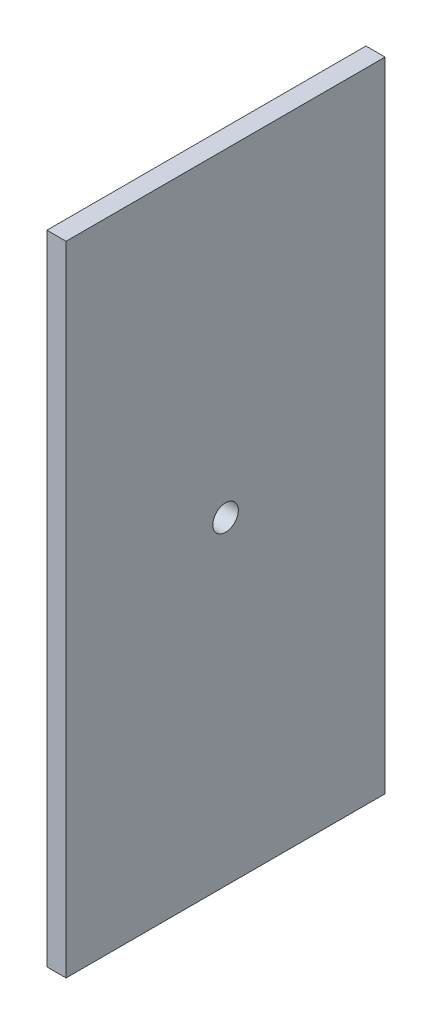
ISO-10303-21;
HEADER;
FILE_DESCRIPTION(('STEP AP214'),'2;1');
FILE_NAME('part.step','',(''),(''),'','','');
FILE_SCHEMA(('AUTOMOTIVE_DESIGN { 1 0 10303 214 1 1 1 1 }'));
ENDSEC;
DATA;
#1=APPLICATION_CONTEXT('core data for automotive mechanical design processes');
#2=APPLICATION_PROTOCOL_DEFINITION('international standard','automotive_design',2000,#1);
#3=PRODUCT_CONTEXT('',#1,'mechanical');
#4=PRODUCT('Part','Part','',(#3));
#5=PRODUCT_RELATED_PRODUCT_CATEGORY('part','',(#4));
#6=PRODUCT_DEFINITION_FORMATION('','',#4);
#7=PRODUCT_DEFINITION_CONTEXT('part definition',#1,'design');
#8=PRODUCT_DEFINITION('design','',#6,#7);
#9=PRODUCT_DEFINITION_SHAPE('','',#8);
#10=(LENGTH_UNIT() NAMED_UNIT(*) SI_UNIT(.MILLI.,.METRE.));
#11=(NAMED_UNIT(*) PLANE_ANGLE_UNIT() SI_UNIT($,.RADIAN.));
#12=(NAMED_UNIT(*) SI_UNIT($,.STERADIAN.) SOLID_ANGLE_UNIT());
#13=UNCERTAINTY_MEASURE_WITH_UNIT(LENGTH_MEASURE(1.E-05),#10,'distance_accuracy_value','');
#14=(GEOMETRIC_REPRESENTATION_CONTEXT(3) GLOBAL_UNCERTAINTY_ASSIGNED_CONTEXT((#13)) GLOBAL_UNIT_ASSIGNED_CONTEXT((#10,
#11,#12)) REPRESENTATION_CONTEXT('',''));
#15=CARTESIAN_POINT('',(0.,0.,0.));
#16=DIRECTION('',(0.,0.,1.));
#17=DIRECTION('',(1.,0.,0.));
#18=AXIS2_PLACEMENT_3D('',#15,#16,#17);
#19=CARTESIAN_POINT('',(0.,160.,100.));
#20=DIRECTION('',(1.,0.,0.));
#21=DIRECTION('',(0.,1.,0.));
#22=AXIS2_PLACEMENT_3D('',#19,#20,#21);
#23=PLANE('',#22);
#24=CARTESIAN_POINT('',(0.,60.,50.));
#25=DIRECTION('',(1.,0.,0.));
#26=DIRECTION('',(0.,0.,-1.));
#27=AXIS2_PLACEMENT_3D('',#24,#25,#26);
#28=CIRCLE('',#27,4.00000000000001);
#29=CARTESIAN_POINT('',(0.,60.,46.));
#30=VERTEX_POINT('',#29);
#31=EDGE_CURVE('E109',#30,#30,#28,.T.);
#32=ORIENTED_EDGE('',*,*,#31,.T.);
#33=EDGE_LOOP('',(#32));
#34=FACE_BOUND('',#33,.T.);
#35=DIRECTION('',(0.,-1.,0.));
#36=VECTOR('',#35,1.);
#37=CARTESIAN_POINT('',(0.,160.,0.));
#38=LINE('',#37,#36);
#39=CARTESIAN_POINT('',(0.,160.,0.));
#40=VERTEX_POINT('',#39);
#41=CARTESIAN_POINT('',(0.,-40.,0.));
#42=VERTEX_POINT('',#41);
#43=EDGE_CURVE('E95',#40,#42,#38,.T.);
#44=ORIENTED_EDGE('',*,*,#43,.T.);
#45=DIRECTION('',(0.,0.,-1.));
#46=VECTOR('',#45,1.);
#47=CARTESIAN_POINT('',(0.,-40.,100.));
#48=LINE('',#47,#46);
#49=CARTESIAN_POINT('',(0.,-40.,100.));
#50=VERTEX_POINT('',#49);
#51=EDGE_CURVE('E11',#50,#42,#48,.T.);
#52=ORIENTED_EDGE('',*,*,#51,.F.);
#53=DIRECTION('',(0.,-1.,0.));
#54=VECTOR('',#53,1.);
#55=CARTESIAN_POINT('',(0.,160.,100.));
#56=LINE('',#55,#54);
#57=CARTESIAN_POINT('',(0.,160.,100.));
#58=VERTEX_POINT('',#57);
#59=EDGE_CURVE('E83',#58,#50,#56,.T.);
#60=ORIENTED_EDGE('',*,*,#59,.F.);
#61=DIRECTION('',(0.,0.,-1.));
#62=VECTOR('',#61,1.);
#63=CARTESIAN_POINT('',(0.,160.,100.));
#64=LINE('',#63,#62);
#65=EDGE_CURVE('E91',#58,#40,#64,.T.);
#66=ORIENTED_EDGE('',*,*,#65,.T.);
#67=EDGE_LOOP('',(#44,#52,#60,#66));
#68=FACE_BOUND('',#67,.T.);
#69=ADVANCED_FACE('F32',(#34,#68),#23,.F.);
#70=CARTESIAN_POINT('',(0.,-40.,100.));
#71=DIRECTION('',(0.,1.,0.));
#72=DIRECTION('',(0.,0.,1.));
#73=AXIS2_PLACEMENT_3D('',#70,#71,#72);
#74=PLANE('',#73);
#75=DIRECTION('',(1.,0.,0.));
#76=VECTOR('',#75,1.);
#77=CARTESIAN_POINT('',(0.,-40.,0.));
#78=LINE('',#77,#76);
#79=CARTESIAN_POINT('',(6.,-40.,0.));
#80=VERTEX_POINT('',#79);
#81=EDGE_CURVE('E87',#42,#80,#78,.T.);
#82=ORIENTED_EDGE('',*,*,#81,.T.);
#83=DIRECTION('',(0.,0.,-1.));
#84=VECTOR('',#83,1.);
#85=CARTESIAN_POINT('',(6.,-40.,100.));
#86=LINE('',#85,#84);
#87=CARTESIAN_POINT('',(6.,-40.,100.));
#88=VERTEX_POINT('',#87);
#89=EDGE_CURVE('E40',#88,#80,#86,.T.);
#90=ORIENTED_EDGE('',*,*,#89,.F.);
#91=DIRECTION('',(1.,0.,0.));
#92=VECTOR('',#91,1.);
#93=CARTESIAN_POINT('',(0.,-40.,100.));
#94=LINE('',#93,#92);
#95=EDGE_CURVE('E78',#50,#88,#94,.T.);
#96=ORIENTED_EDGE('',*,*,#95,.F.);
#97=ORIENTED_EDGE('',*,*,#51,.T.);
#98=EDGE_LOOP('',(#82,#90,#96,#97));
#99=FACE_BOUND('',#98,.T.);
#100=ADVANCED_FACE('F86',(#99),#74,.F.);
#101=CARTESIAN_POINT('',(5.99999999999998,160.,100.));
#102=DIRECTION('',(-1.,0.,0.));
#103=DIRECTION('',(0.,-1.,0.));
#104=AXIS2_PLACEMENT_3D('',#101,#102,#103);
#105=PLANE('',#104);
#106=CARTESIAN_POINT('',(6.,60.,50.));
#107=DIRECTION('',(1.,0.,0.));
#108=DIRECTION('',(0.,0.,-1.));
#109=AXIS2_PLACEMENT_3D('',#106,#107,#108);
#110=CIRCLE('',#109,4.00000000000001);
#111=CARTESIAN_POINT('',(6.,60.,46.));
#112=VERTEX_POINT('',#111);
#113=EDGE_CURVE('E98',#112,#112,#110,.T.);
#114=ORIENTED_EDGE('',*,*,#113,.F.);
#115=EDGE_LOOP('',(#114));
#116=FACE_BOUND('',#115,.T.);
#117=DIRECTION('',(0.,1.,0.));
#118=VECTOR('',#117,1.);
#119=CARTESIAN_POINT('',(5.99999999999998,160.,0.));
#120=LINE('',#119,#118);
#121=CARTESIAN_POINT('',(5.99999999999998,160.,0.));
#122=VERTEX_POINT('',#121);
#123=EDGE_CURVE('E65',#80,#122,#120,.T.);
#124=ORIENTED_EDGE('',*,*,#123,.T.);
#125=DIRECTION('',(0.,0.,-1.));
#126=VECTOR('',#125,1.);
#127=CARTESIAN_POINT('',(5.99999999999998,160.,100.));
#128=LINE('',#127,#126);
#129=CARTESIAN_POINT('',(5.99999999999998,160.,100.));
#130=VERTEX_POINT('',#129);
#131=EDGE_CURVE('E88',#130,#122,#128,.T.);
#132=ORIENTED_EDGE('',*,*,#131,.F.);
#133=DIRECTION('',(0.,1.,0.));
#134=VECTOR('',#133,1.);
#135=CARTESIAN_POINT('',(5.99999999999998,160.,100.));
#136=LINE('',#135,#134);
#137=EDGE_CURVE('E81',#88,#130,#136,.T.);
#138=ORIENTED_EDGE('',*,*,#137,.F.);
#139=ORIENTED_EDGE('',*,*,#89,.T.);
#140=EDGE_LOOP('',(#124,#132,#138,#139));
#141=FACE_BOUND('',#140,.T.);
#142=ADVANCED_FACE('F89',(#116,#141),#105,.F.);
#143=CARTESIAN_POINT('',(0.,160.,100.));
#144=DIRECTION('',(0.,-1.,0.));
#145=DIRECTION('',(0.,0.,-1.));
#146=AXIS2_PLACEMENT_3D('',#143,#144,#145);
#147=PLANE('',#146);
#148=DIRECTION('',(-1.,0.,0.));
#149=VECTOR('',#148,1.);
#150=CARTESIAN_POINT('',(0.,160.,0.));
#151=LINE('',#150,#149);
#152=EDGE_CURVE('E71',#122,#40,#151,.T.);
#153=ORIENTED_EDGE('',*,*,#152,.T.);
#154=ORIENTED_EDGE('',*,*,#65,.F.);
#155=DIRECTION('',(-1.,0.,0.));
#156=VECTOR('',#155,1.);
#157=CARTESIAN_POINT('',(0.,160.,100.));
#158=LINE('',#157,#156);
#159=EDGE_CURVE('E48',#130,#58,#158,.T.);
#160=ORIENTED_EDGE('',*,*,#159,.F.);
#161=ORIENTED_EDGE('',*,*,#131,.T.);
#162=EDGE_LOOP('',(#153,#154,#160,#161));
#163=FACE_BOUND('',#162,.T.);
#164=ADVANCED_FACE('F103',(#163),#147,.F.);
#165=CARTESIAN_POINT('',(0.,0.,100.));
#166=DIRECTION('',(0.,0.,1.));
#167=DIRECTION('',(1.,0.,0.));
#168=AXIS2_PLACEMENT_3D('',#165,#166,#167);
#169=PLANE('',#168);
#170=ORIENTED_EDGE('',*,*,#59,.T.);
#171=ORIENTED_EDGE('',*,*,#95,.T.);
#172=ORIENTED_EDGE('',*,*,#137,.T.);
#173=ORIENTED_EDGE('',*,*,#159,.T.);
#174=EDGE_LOOP('',(#170,#171,#172,#173));
#175=FACE_BOUND('',#174,.T.);
#176=ADVANCED_FACE('F79',(#175),#169,.T.);
#177=CARTESIAN_POINT('',(0.,0.,0.));
#178=DIRECTION('',(0.,0.,1.));
#179=DIRECTION('',(1.,0.,0.));
#180=AXIS2_PLACEMENT_3D('',#177,#178,#179);
#181=PLANE('',#180);
#182=ORIENTED_EDGE('',*,*,#43,.F.);
#183=ORIENTED_EDGE('',*,*,#152,.F.);
#184=ORIENTED_EDGE('',*,*,#123,.F.);
#185=ORIENTED_EDGE('',*,*,#81,.F.);
#186=EDGE_LOOP('',(#182,#183,#184,#185));
#187=FACE_BOUND('',#186,.T.);
#188=ADVANCED_FACE('F106',(#187),#181,.F.);
#189=CARTESIAN_POINT('',(6.,60.,50.));
#190=DIRECTION('',(-1.,0.,0.));
#191=DIRECTION('',(0.,0.,1.));
#192=AXIS2_PLACEMENT_3D('',#189,#190,#191);
#193=CYLINDRICAL_SURFACE('',#192,4.00000000000001);
#194=ORIENTED_EDGE('',*,*,#113,.T.);
#195=EDGE_LOOP('',(#194));
#196=FACE_BOUND('',#195,.T.);
#197=ORIENTED_EDGE('',*,*,#31,.F.);
#198=EDGE_LOOP('',(#197));
#199=FACE_BOUND('',#198,.T.);
#200=ADVANCED_FACE('F115',(#196,#199),#193,.F.);
#201=CLOSED_SHELL('',(#69,#100,#142,#164,#176,#188,#200));
#202=MANIFOLD_SOLID_BREP('B2',#201);
#203=ADVANCED_BREP_SHAPE_REPRESENTATION('',(#18,#202),#14);
#204=SHAPE_DEFINITION_REPRESENTATION(#9,#203);
ENDSEC;
END-ISO-10303-21;
